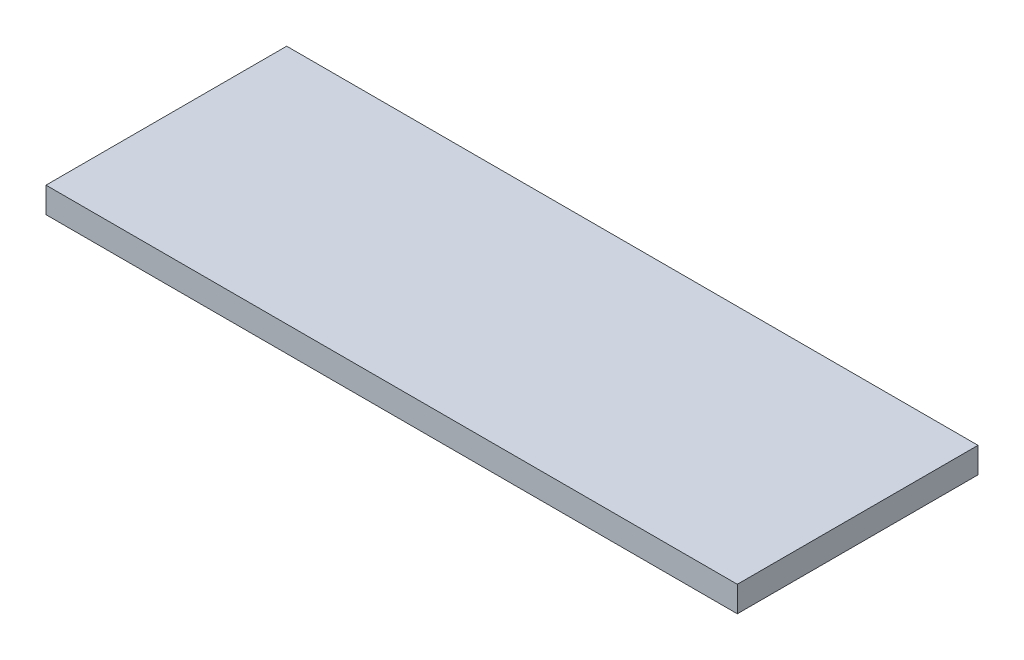
ISO-10303-21;
HEADER;
FILE_DESCRIPTION(('STEP AP214'),'2;1');
FILE_NAME('part.step','',(''),(''),'','','');
FILE_SCHEMA(('AUTOMOTIVE_DESIGN { 1 0 10303 214 1 1 1 1 }'));
ENDSEC;
DATA;
#1=APPLICATION_CONTEXT('core data for automotive mechanical design processes');
#2=APPLICATION_PROTOCOL_DEFINITION('international standard','automotive_design',2000,#1);
#3=PRODUCT_CONTEXT('',#1,'mechanical');
#4=PRODUCT('Part','Part','',(#3));
#5=PRODUCT_RELATED_PRODUCT_CATEGORY('part','',(#4));
#6=PRODUCT_DEFINITION_FORMATION('','',#4);
#7=PRODUCT_DEFINITION_CONTEXT('part definition',#1,'design');
#8=PRODUCT_DEFINITION('design','',#6,#7);
#9=PRODUCT_DEFINITION_SHAPE('','',#8);
#10=(LENGTH_UNIT() NAMED_UNIT(*) SI_UNIT(.MILLI.,.METRE.));
#11=(NAMED_UNIT(*) PLANE_ANGLE_UNIT() SI_UNIT($,.RADIAN.));
#12=(NAMED_UNIT(*) SI_UNIT($,.STERADIAN.) SOLID_ANGLE_UNIT());
#13=UNCERTAINTY_MEASURE_WITH_UNIT(LENGTH_MEASURE(1.E-05),#10,'distance_accuracy_value','');
#14=(GEOMETRIC_REPRESENTATION_CONTEXT(3) GLOBAL_UNCERTAINTY_ASSIGNED_CONTEXT((#13)) GLOBAL_UNIT_ASSIGNED_CONTEXT((#10,
#11,#12)) REPRESENTATION_CONTEXT('',''));
#15=CARTESIAN_POINT('',(0.,0.,0.));
#16=DIRECTION('',(0.,0.,1.));
#17=DIRECTION('',(1.,0.,0.));
#18=AXIS2_PLACEMENT_3D('',#15,#16,#17);
#19=CARTESIAN_POINT('',(-81.,6.00000000000001,-28.2));
#20=DIRECTION('',(0.,0.,-1.));
#21=DIRECTION('',(-1.,0.,0.));
#22=AXIS2_PLACEMENT_3D('',#19,#20,#21);
#23=PLANE('',#22);
#24=DIRECTION('',(1.,0.,0.));
#25=VECTOR('',#24,1.);
#26=CARTESIAN_POINT('',(-81.,0.,-28.2));
#27=LINE('',#26,#25);
#28=CARTESIAN_POINT('',(-81.,0.,-28.2));
#29=VERTEX_POINT('',#28);
#30=CARTESIAN_POINT('',(81.,0.,-28.2));
#31=VERTEX_POINT('',#30);
#32=EDGE_CURVE('E114',#29,#31,#27,.T.);
#33=ORIENTED_EDGE('',*,*,#32,.F.);
#34=DIRECTION('',(0.,-1.,0.));
#35=VECTOR('',#34,1.);
#36=CARTESIAN_POINT('',(-81.,6.00000000000001,-28.2));
#37=LINE('',#36,#35);
#38=CARTESIAN_POINT('',(-81.,6.00000000000001,-28.2));
#39=VERTEX_POINT('',#38);
#40=EDGE_CURVE('E11',#39,#29,#37,.T.);
#41=ORIENTED_EDGE('',*,*,#40,.F.);
#42=DIRECTION('',(1.,0.,0.));
#43=VECTOR('',#42,1.);
#44=CARTESIAN_POINT('',(-81.,6.00000000000001,-28.2));
#45=LINE('',#44,#43);
#46=CARTESIAN_POINT('',(81.,6.00000000000001,-28.2));
#47=VERTEX_POINT('',#46);
#48=EDGE_CURVE('E107',#39,#47,#45,.T.);
#49=ORIENTED_EDGE('',*,*,#48,.T.);
#50=DIRECTION('',(0.,-1.,0.));
#51=VECTOR('',#50,1.);
#52=CARTESIAN_POINT('',(81.,6.00000000000001,-28.2));
#53=LINE('',#52,#51);
#54=EDGE_CURVE('E46',#47,#31,#53,.T.);
#55=ORIENTED_EDGE('',*,*,#54,.T.);
#56=EDGE_LOOP('',(#33,#41,#49,#55));
#57=FACE_BOUND('',#56,.T.);
#58=ADVANCED_FACE('F43',(#57),#23,.T.);
#59=CARTESIAN_POINT('',(-81.,6.00000000000001,-28.2));
#60=DIRECTION('',(1.,0.,0.));
#61=DIRECTION('',(0.,0.,-1.));
#62=AXIS2_PLACEMENT_3D('',#59,#60,#61);
#63=PLANE('',#62);
#64=DIRECTION('',(0.,0.,1.));
#65=VECTOR('',#64,1.);
#66=CARTESIAN_POINT('',(-81.,0.,-28.2));
#67=LINE('',#66,#65);
#68=CARTESIAN_POINT('',(-81.,0.,28.2));
#69=VERTEX_POINT('',#68);
#70=EDGE_CURVE('E77',#29,#69,#67,.T.);
#71=ORIENTED_EDGE('',*,*,#70,.T.);
#72=DIRECTION('',(0.,-1.,0.));
#73=VECTOR('',#72,1.);
#74=CARTESIAN_POINT('',(-81.,6.00000000000001,28.2));
#75=LINE('',#74,#73);
#76=CARTESIAN_POINT('',(-81.,6.00000000000001,28.2));
#77=VERTEX_POINT('',#76);
#78=EDGE_CURVE('E53',#77,#69,#75,.T.);
#79=ORIENTED_EDGE('',*,*,#78,.F.);
#80=DIRECTION('',(0.,0.,1.));
#81=VECTOR('',#80,1.);
#82=CARTESIAN_POINT('',(-81.,6.00000000000001,-28.2));
#83=LINE('',#82,#81);
#84=EDGE_CURVE('E94',#39,#77,#83,.T.);
#85=ORIENTED_EDGE('',*,*,#84,.F.);
#86=ORIENTED_EDGE('',*,*,#40,.T.);
#87=EDGE_LOOP('',(#71,#79,#85,#86));
#88=FACE_BOUND('',#87,.T.);
#89=ADVANCED_FACE('F130',(#88),#63,.F.);
#90=CARTESIAN_POINT('',(-81.,6.00000000000001,28.2));
#91=DIRECTION('',(0.,0.,-1.));
#92=DIRECTION('',(-1.,0.,0.));
#93=AXIS2_PLACEMENT_3D('',#90,#91,#92);
#94=PLANE('',#93);
#95=DIRECTION('',(1.,0.,0.));
#96=VECTOR('',#95,1.);
#97=CARTESIAN_POINT('',(-81.,0.,28.2));
#98=LINE('',#97,#96);
#99=CARTESIAN_POINT('',(81.,0.,28.2));
#100=VERTEX_POINT('',#99);
#101=EDGE_CURVE('E102',#69,#100,#98,.T.);
#102=ORIENTED_EDGE('',*,*,#101,.T.);
#103=DIRECTION('',(0.,-1.,0.));
#104=VECTOR('',#103,1.);
#105=CARTESIAN_POINT('',(81.,6.00000000000001,28.2));
#106=LINE('',#105,#104);
#107=CARTESIAN_POINT('',(81.,6.00000000000001,28.2));
#108=VERTEX_POINT('',#107);
#109=EDGE_CURVE('E99',#108,#100,#106,.T.);
#110=ORIENTED_EDGE('',*,*,#109,.F.);
#111=DIRECTION('',(1.,0.,0.));
#112=VECTOR('',#111,1.);
#113=CARTESIAN_POINT('',(-81.,6.00000000000001,28.2));
#114=LINE('',#113,#112);
#115=EDGE_CURVE('E89',#77,#108,#114,.T.);
#116=ORIENTED_EDGE('',*,*,#115,.F.);
#117=ORIENTED_EDGE('',*,*,#78,.T.);
#118=EDGE_LOOP('',(#102,#110,#116,#117));
#119=FACE_BOUND('',#118,.T.);
#120=ADVANCED_FACE('F100',(#119),#94,.F.);
#121=CARTESIAN_POINT('',(81.,6.00000000000001,-28.2));
#122=DIRECTION('',(1.,0.,0.));
#123=DIRECTION('',(0.,0.,-1.));
#124=AXIS2_PLACEMENT_3D('',#121,#122,#123);
#125=PLANE('',#124);
#126=DIRECTION('',(0.,0.,1.));
#127=VECTOR('',#126,1.);
#128=CARTESIAN_POINT('',(81.,0.,-28.2));
#129=LINE('',#128,#127);
#130=EDGE_CURVE('E118',#31,#100,#129,.T.);
#131=ORIENTED_EDGE('',*,*,#130,.F.);
#132=ORIENTED_EDGE('',*,*,#54,.F.);
#133=DIRECTION('',(0.,0.,1.));
#134=VECTOR('',#133,1.);
#135=CARTESIAN_POINT('',(81.,6.00000000000001,-28.2));
#136=LINE('',#135,#134);
#137=EDGE_CURVE('E93',#47,#108,#136,.T.);
#138=ORIENTED_EDGE('',*,*,#137,.T.);
#139=ORIENTED_EDGE('',*,*,#109,.T.);
#140=EDGE_LOOP('',(#131,#132,#138,#139));
#141=FACE_BOUND('',#140,.T.);
#142=ADVANCED_FACE('F105',(#141),#125,.T.);
#143=CARTESIAN_POINT('',(0.,6.00000000000001,0.));
#144=DIRECTION('',(0.,-1.,0.));
#145=DIRECTION('',(0.,0.,-1.));
#146=AXIS2_PLACEMENT_3D('',#143,#144,#145);
#147=PLANE('',#146);
#148=ORIENTED_EDGE('',*,*,#48,.F.);
#149=ORIENTED_EDGE('',*,*,#84,.T.);
#150=ORIENTED_EDGE('',*,*,#115,.T.);
#151=ORIENTED_EDGE('',*,*,#137,.F.);
#152=EDGE_LOOP('',(#148,#149,#150,#151));
#153=FACE_BOUND('',#152,.T.);
#154=ADVANCED_FACE('F92',(#153),#147,.F.);
#155=CARTESIAN_POINT('',(0.,0.,0.));
#156=DIRECTION('',(0.,-1.,0.));
#157=DIRECTION('',(0.,0.,-1.));
#158=AXIS2_PLACEMENT_3D('',#155,#156,#157);
#159=PLANE('',#158);
#160=ORIENTED_EDGE('',*,*,#32,.T.);
#161=ORIENTED_EDGE('',*,*,#130,.T.);
#162=ORIENTED_EDGE('',*,*,#101,.F.);
#163=ORIENTED_EDGE('',*,*,#70,.F.);
#164=EDGE_LOOP('',(#160,#161,#162,#163));
#165=FACE_BOUND('',#164,.T.);
#166=ADVANCED_FACE('F127',(#165),#159,.T.);
#167=CLOSED_SHELL('',(#58,#89,#120,#142,#154,#166));
#168=MANIFOLD_SOLID_BREP('B2',#167);
#169=ADVANCED_BREP_SHAPE_REPRESENTATION('',(#18,#168),#14);
#170=SHAPE_DEFINITION_REPRESENTATION(#9,#169);
ENDSEC;
END-ISO-10303-21;
